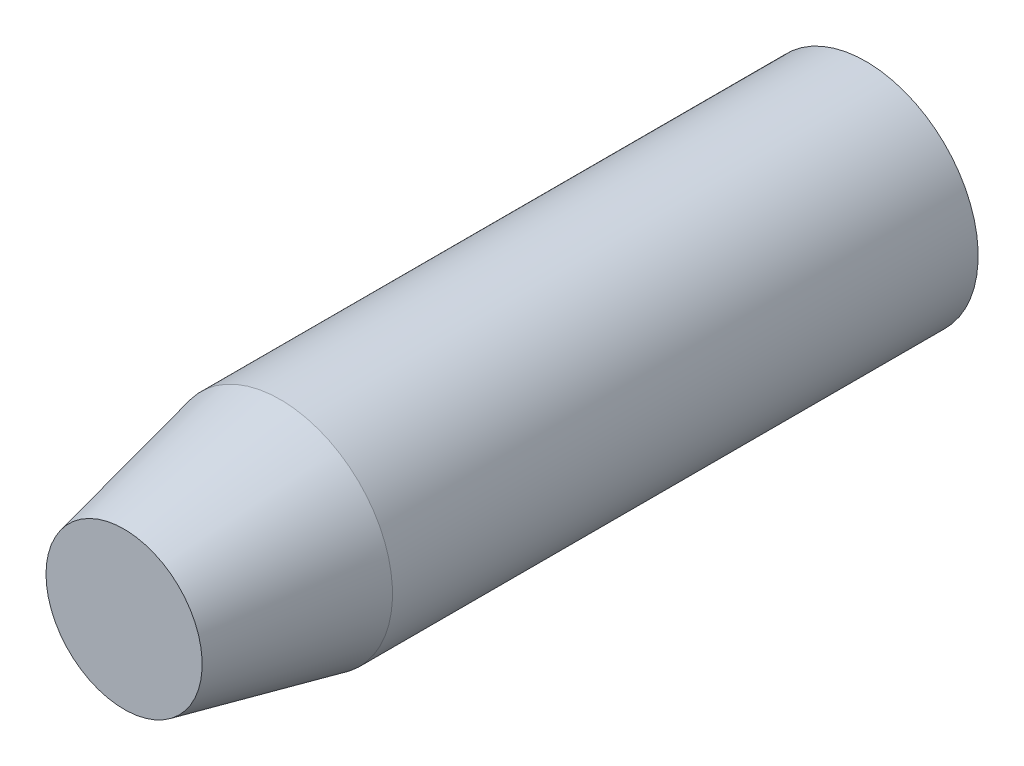
ISO-10303-21;
HEADER;
FILE_DESCRIPTION(('STEP AP214'),'2;1');
FILE_NAME('part.step','',(''),(''),'','','');
FILE_SCHEMA(('AUTOMOTIVE_DESIGN { 1 0 10303 214 1 1 1 1 }'));
ENDSEC;
DATA;
#1=APPLICATION_CONTEXT('core data for automotive mechanical design processes');
#2=APPLICATION_PROTOCOL_DEFINITION('international standard','automotive_design',2000,#1);
#3=PRODUCT_CONTEXT('',#1,'mechanical');
#4=PRODUCT('Part','Part','',(#3));
#5=PRODUCT_RELATED_PRODUCT_CATEGORY('part','',(#4));
#6=PRODUCT_DEFINITION_FORMATION('','',#4);
#7=PRODUCT_DEFINITION_CONTEXT('part definition',#1,'design');
#8=PRODUCT_DEFINITION('design','',#6,#7);
#9=PRODUCT_DEFINITION_SHAPE('','',#8);
#10=(LENGTH_UNIT() NAMED_UNIT(*) SI_UNIT(.MILLI.,.METRE.));
#11=(NAMED_UNIT(*) PLANE_ANGLE_UNIT() SI_UNIT($,.RADIAN.));
#12=(NAMED_UNIT(*) SI_UNIT($,.STERADIAN.) SOLID_ANGLE_UNIT());
#13=UNCERTAINTY_MEASURE_WITH_UNIT(LENGTH_MEASURE(1.E-05),#10,'distance_accuracy_value','');
#14=(GEOMETRIC_REPRESENTATION_CONTEXT(3) GLOBAL_UNCERTAINTY_ASSIGNED_CONTEXT((#13)) GLOBAL_UNIT_ASSIGNED_CONTEXT((#10,
#11,#12)) REPRESENTATION_CONTEXT('',''));
#15=CARTESIAN_POINT('',(0.,0.,0.));
#16=DIRECTION('',(0.,0.,1.));
#17=DIRECTION('',(1.,0.,0.));
#18=AXIS2_PLACEMENT_3D('',#15,#16,#17);
#19=CARTESIAN_POINT('',(0.,0.,0.));
#20=DIRECTION('',(0.,0.,-1.));
#21=DIRECTION('',(-1.,0.,0.));
#22=AXIS2_PLACEMENT_3D('',#19,#20,#21);
#23=PLANE('',#22);
#24=CARTESIAN_POINT('',(0.,0.,0.));
#25=DIRECTION('',(0.,0.,-1.));
#26=DIRECTION('',(-1.,0.,0.));
#27=AXIS2_PLACEMENT_3D('',#24,#25,#26);
#28=CIRCLE('',#27,12.6999999999997);
#29=CARTESIAN_POINT('',(-12.6999999999997,0.,0.));
#30=VERTEX_POINT('',#29);
#31=EDGE_CURVE('E17',#30,#30,#28,.T.);
#32=ORIENTED_EDGE('',*,*,#31,.F.);
#33=EDGE_LOOP('',(#32));
#34=FACE_BOUND('',#33,.T.);
#35=ADVANCED_FACE('F14',(#34),#23,.F.);
#36=CARTESIAN_POINT('',(0.,0.,-120.65));
#37=DIRECTION('',(0.,0.,-1.));
#38=DIRECTION('',(-1.,0.,0.));
#39=AXIS2_PLACEMENT_3D('',#36,#37,#38);
#40=PLANE('',#39);
#41=CARTESIAN_POINT('',(0.,0.,-120.65));
#42=DIRECTION('',(0.,0.,-1.));
#43=DIRECTION('',(-1.,0.,0.));
#44=AXIS2_PLACEMENT_3D('',#41,#42,#43);
#45=CIRCLE('',#44,18.25625);
#46=CARTESIAN_POINT('',(-18.25625,0.,-120.65));
#47=VERTEX_POINT('',#46);
#48=EDGE_CURVE('E21',#47,#47,#45,.F.);
#49=ORIENTED_EDGE('',*,*,#48,.F.);
#50=EDGE_LOOP('',(#49));
#51=FACE_BOUND('',#50,.T.);
#52=ADVANCED_FACE('F35',(#51),#40,.T.);
#53=CARTESIAN_POINT('',(0.,0.,-25.3999999999999));
#54=DIRECTION('',(0.,0.,-1.));
#55=DIRECTION('',(-1.,0.,0.));
#56=AXIS2_PLACEMENT_3D('',#53,#54,#55);
#57=CONICAL_SURFACE('',#56,18.2562500000003,0.215357699697764);
#58=ORIENTED_EDGE('',*,*,#31,.T.);
#59=EDGE_LOOP('',(#58));
#60=FACE_BOUND('',#59,.T.);
#61=CARTESIAN_POINT('',(0.,0.,-25.4));
#62=DIRECTION('',(0.,0.,-1.));
#63=DIRECTION('',(-1.,0.,0.));
#64=AXIS2_PLACEMENT_3D('',#61,#62,#63);
#65=CIRCLE('',#64,18.25625);
#66=CARTESIAN_POINT('',(-18.25625,0.,-25.4));
#67=VERTEX_POINT('',#66);
#68=EDGE_CURVE('E10',#67,#67,#65,.T.);
#69=ORIENTED_EDGE('',*,*,#68,.F.);
#70=EDGE_LOOP('',(#69));
#71=FACE_BOUND('',#70,.T.);
#72=ADVANCED_FACE('F31',(#60,#71),#57,.T.);
#73=CARTESIAN_POINT('',(0.,0.,0.));
#74=DIRECTION('',(0.,0.,-1.));
#75=DIRECTION('',(-1.,0.,0.));
#76=AXIS2_PLACEMENT_3D('',#73,#74,#75);
#77=CYLINDRICAL_SURFACE('',#76,18.25625);
#78=ORIENTED_EDGE('',*,*,#68,.T.);
#79=EDGE_LOOP('',(#78));
#80=FACE_BOUND('',#79,.T.);
#81=ORIENTED_EDGE('',*,*,#48,.T.);
#82=EDGE_LOOP('',(#81));
#83=FACE_BOUND('',#82,.T.);
#84=ADVANCED_FACE('F41',(#80,#83),#77,.T.);
#85=CLOSED_SHELL('',(#35,#52,#72,#84));
#86=MANIFOLD_SOLID_BREP('B1',#85);
#87=ADVANCED_BREP_SHAPE_REPRESENTATION('',(#18,#86),#14);
#88=SHAPE_DEFINITION_REPRESENTATION(#9,#87);
ENDSEC;
END-ISO-10303-21;
